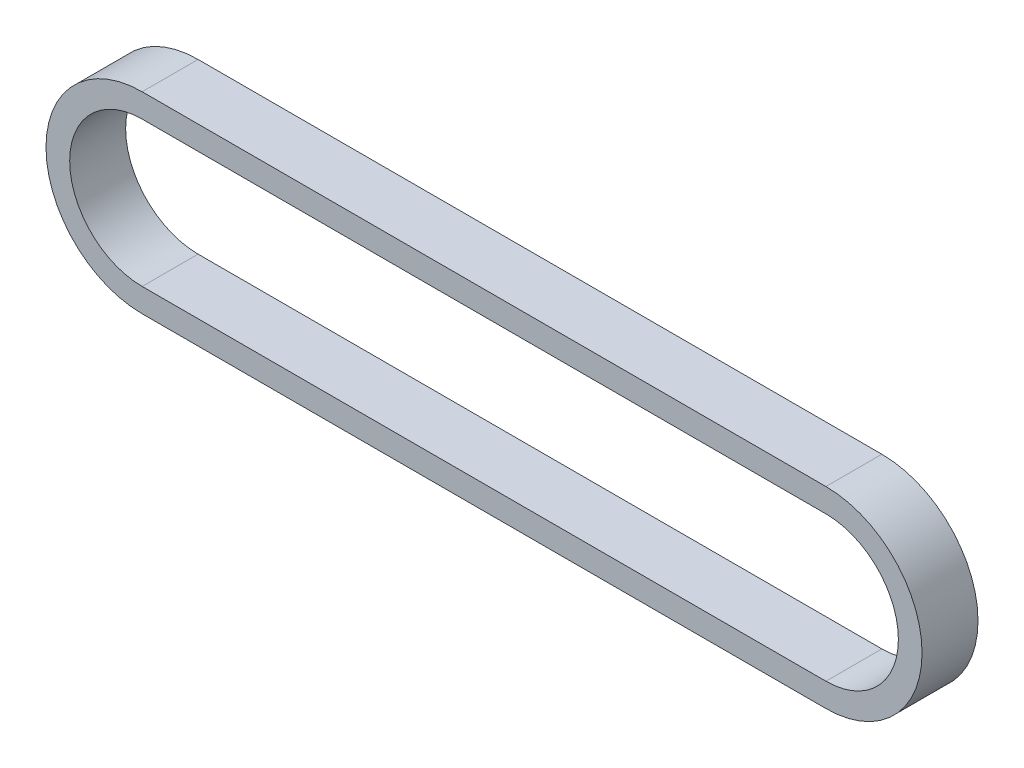
ISO-10303-21;
HEADER;
FILE_DESCRIPTION(('STEP AP214'),'2;1');
FILE_NAME('part.step','',(''),(''),'','','');
FILE_SCHEMA(('AUTOMOTIVE_DESIGN { 1 0 10303 214 1 1 1 1 }'));
ENDSEC;
DATA;
#1=APPLICATION_CONTEXT('core data for automotive mechanical design processes');
#2=APPLICATION_PROTOCOL_DEFINITION('international standard','automotive_design',2000,#1);
#3=PRODUCT_CONTEXT('',#1,'mechanical');
#4=PRODUCT('Part','Part','',(#3));
#5=PRODUCT_RELATED_PRODUCT_CATEGORY('part','',(#4));
#6=PRODUCT_DEFINITION_FORMATION('','',#4);
#7=PRODUCT_DEFINITION_CONTEXT('part definition',#1,'design');
#8=PRODUCT_DEFINITION('design','',#6,#7);
#9=PRODUCT_DEFINITION_SHAPE('','',#8);
#10=(LENGTH_UNIT() NAMED_UNIT(*) SI_UNIT(.MILLI.,.METRE.));
#11=(NAMED_UNIT(*) PLANE_ANGLE_UNIT() SI_UNIT($,.RADIAN.));
#12=(NAMED_UNIT(*) SI_UNIT($,.STERADIAN.) SOLID_ANGLE_UNIT());
#13=UNCERTAINTY_MEASURE_WITH_UNIT(LENGTH_MEASURE(1.E-05),#10,'distance_accuracy_value','');
#14=(GEOMETRIC_REPRESENTATION_CONTEXT(3) GLOBAL_UNCERTAINTY_ASSIGNED_CONTEXT((#13)) GLOBAL_UNIT_ASSIGNED_CONTEXT((#10,
#11,#12)) REPRESENTATION_CONTEXT('',''));
#15=CARTESIAN_POINT('',(0.,0.,0.));
#16=DIRECTION('',(0.,0.,1.));
#17=DIRECTION('',(1.,0.,0.));
#18=AXIS2_PLACEMENT_3D('',#15,#16,#17);
#19=CARTESIAN_POINT('',(0.,0.,4.5));
#20=DIRECTION('',(0.,0.,1.));
#21=DIRECTION('',(1.,0.,0.));
#22=AXIS2_PLACEMENT_3D('',#19,#20,#21);
#23=PLANE('',#22);
#24=CARTESIAN_POINT('',(0.,0.,4.5));
#25=DIRECTION('',(0.,0.,1.));
#26=DIRECTION('',(1.,0.,0.));
#27=AXIS2_PLACEMENT_3D('',#24,#25,#26);
#28=CIRCLE('',#27,15.4669567079091);
#29=CARTESIAN_POINT('',(0.,15.4669567079091,4.5));
#30=VERTEX_POINT('',#29);
#31=CARTESIAN_POINT('',(0.,-15.4669567079091,4.5));
#32=VERTEX_POINT('',#31);
#33=EDGE_CURVE('E158',#30,#32,#28,.T.);
#34=ORIENTED_EDGE('',*,*,#33,.T.);
#35=DIRECTION('',(1.,0.,0.));
#36=VECTOR('',#35,1.);
#37=CARTESIAN_POINT('',(0.,-15.4669567079091,4.5));
#38=LINE('',#37,#36);
#39=CARTESIAN_POINT('',(109.999999964,-15.4669567079091,4.5));
#40=VERTEX_POINT('',#39);
#41=EDGE_CURVE('E161',#32,#40,#38,.T.);
#42=ORIENTED_EDGE('',*,*,#41,.T.);
#43=CARTESIAN_POINT('',(109.999999964,0.,4.5));
#44=DIRECTION('',(0.,0.,1.));
#45=DIRECTION('',(1.,0.,0.));
#46=AXIS2_PLACEMENT_3D('',#43,#44,#45);
#47=CIRCLE('',#46,15.4669567079091);
#48=CARTESIAN_POINT('',(109.999999964,15.4669567079091,4.5));
#49=VERTEX_POINT('',#48);
#50=EDGE_CURVE('E164',#40,#49,#47,.T.);
#51=ORIENTED_EDGE('',*,*,#50,.T.);
#52=DIRECTION('',(-1.,0.,0.));
#53=VECTOR('',#52,1.);
#54=CARTESIAN_POINT('',(0.,15.4669567079091,4.5));
#55=LINE('',#54,#53);
#56=EDGE_CURVE('E166',#49,#30,#55,.T.);
#57=ORIENTED_EDGE('',*,*,#56,.T.);
#58=EDGE_LOOP('',(#34,#42,#51,#57));
#59=FACE_BOUND('',#58,.T.);
#60=DIRECTION('',(1.,0.,0.));
#61=VECTOR('',#60,1.);
#62=CARTESIAN_POINT('',(0.,-11.6569567079091,4.5));
#63=LINE('',#62,#61);
#64=CARTESIAN_POINT('',(0.,-11.6569567079091,4.5));
#65=VERTEX_POINT('',#64);
#66=CARTESIAN_POINT('',(109.999999964,-11.656956707909,4.5));
#67=VERTEX_POINT('',#66);
#68=EDGE_CURVE('E130',#65,#67,#63,.T.);
#69=ORIENTED_EDGE('',*,*,#68,.F.);
#70=CARTESIAN_POINT('',(0.,0.,4.5));
#71=DIRECTION('',(0.,0.,1.));
#72=DIRECTION('',(1.,0.,0.));
#73=AXIS2_PLACEMENT_3D('',#70,#71,#72);
#74=CIRCLE('',#73,11.6569567079091);
#75=CARTESIAN_POINT('',(0.,11.6569567079091,4.5));
#76=VERTEX_POINT('',#75);
#77=EDGE_CURVE('E122',#76,#65,#74,.T.);
#78=ORIENTED_EDGE('',*,*,#77,.F.);
#79=DIRECTION('',(-1.,0.,0.));
#80=VECTOR('',#79,1.);
#81=CARTESIAN_POINT('',(0.,11.6569567079091,4.5));
#82=LINE('',#81,#80);
#83=CARTESIAN_POINT('',(109.999999964,11.656956707909,4.5));
#84=VERTEX_POINT('',#83);
#85=EDGE_CURVE('E144',#84,#76,#82,.T.);
#86=ORIENTED_EDGE('',*,*,#85,.F.);
#87=CARTESIAN_POINT('',(109.999999964,0.,4.5));
#88=DIRECTION('',(0.,0.,1.));
#89=DIRECTION('',(1.,0.,0.));
#90=AXIS2_PLACEMENT_3D('',#87,#88,#89);
#91=CIRCLE('',#90,11.656956707909);
#92=EDGE_CURVE('E142',#67,#84,#91,.T.);
#93=ORIENTED_EDGE('',*,*,#92,.F.);
#94=EDGE_LOOP('',(#69,#78,#86,#93));
#95=FACE_BOUND('',#94,.T.);
#96=ADVANCED_FACE('F57',(#59,#95),#23,.T.);
#97=CARTESIAN_POINT('',(0.,0.,-4.5));
#98=DIRECTION('',(0.,0.,1.));
#99=DIRECTION('',(1.,0.,0.));
#100=AXIS2_PLACEMENT_3D('',#97,#98,#99);
#101=PLANE('',#100);
#102=CARTESIAN_POINT('',(0.,0.,-4.5));
#103=DIRECTION('',(0.,0.,1.));
#104=DIRECTION('',(1.,0.,0.));
#105=AXIS2_PLACEMENT_3D('',#102,#103,#104);
#106=CIRCLE('',#105,15.4669567079091);
#107=CARTESIAN_POINT('',(0.,15.4669567079091,-4.5));
#108=VERTEX_POINT('',#107);
#109=CARTESIAN_POINT('',(0.,-15.4669567079091,-4.5));
#110=VERTEX_POINT('',#109);
#111=EDGE_CURVE('E138',#108,#110,#106,.T.);
#112=ORIENTED_EDGE('',*,*,#111,.F.);
#113=DIRECTION('',(-1.,0.,0.));
#114=VECTOR('',#113,1.);
#115=CARTESIAN_POINT('',(0.,15.4669567079091,-4.5));
#116=LINE('',#115,#114);
#117=CARTESIAN_POINT('',(109.999999964,15.4669567079091,-4.5));
#118=VERTEX_POINT('',#117);
#119=EDGE_CURVE('E162',#118,#108,#116,.T.);
#120=ORIENTED_EDGE('',*,*,#119,.F.);
#121=CARTESIAN_POINT('',(109.999999964,0.,-4.5));
#122=DIRECTION('',(0.,0.,1.));
#123=DIRECTION('',(1.,0.,0.));
#124=AXIS2_PLACEMENT_3D('',#121,#122,#123);
#125=CIRCLE('',#124,15.4669567079091);
#126=CARTESIAN_POINT('',(109.999999964,-15.4669567079091,-4.5));
#127=VERTEX_POINT('',#126);
#128=EDGE_CURVE('E173',#127,#118,#125,.T.);
#129=ORIENTED_EDGE('',*,*,#128,.F.);
#130=DIRECTION('',(1.,0.,0.));
#131=VECTOR('',#130,1.);
#132=CARTESIAN_POINT('',(0.,-15.4669567079091,-4.5));
#133=LINE('',#132,#131);
#134=EDGE_CURVE('E171',#110,#127,#133,.T.);
#135=ORIENTED_EDGE('',*,*,#134,.F.);
#136=EDGE_LOOP('',(#112,#120,#129,#135));
#137=FACE_BOUND('',#136,.T.);
#138=CARTESIAN_POINT('',(0.,0.,-4.5));
#139=DIRECTION('',(0.,0.,1.));
#140=DIRECTION('',(1.,0.,0.));
#141=AXIS2_PLACEMENT_3D('',#138,#139,#140);
#142=CIRCLE('',#141,11.6569567079091);
#143=CARTESIAN_POINT('',(0.,11.6569567079091,-4.5));
#144=VERTEX_POINT('',#143);
#145=CARTESIAN_POINT('',(0.,-11.6569567079091,-4.5));
#146=VERTEX_POINT('',#145);
#147=EDGE_CURVE('E80',#144,#146,#142,.T.);
#148=ORIENTED_EDGE('',*,*,#147,.T.);
#149=DIRECTION('',(1.,0.,0.));
#150=VECTOR('',#149,1.);
#151=CARTESIAN_POINT('',(0.,-11.6569567079091,-4.5));
#152=LINE('',#151,#150);
#153=CARTESIAN_POINT('',(109.999999964,-11.656956707909,-4.5));
#154=VERTEX_POINT('',#153);
#155=EDGE_CURVE('E137',#146,#154,#152,.T.);
#156=ORIENTED_EDGE('',*,*,#155,.T.);
#157=CARTESIAN_POINT('',(109.999999964,0.,-4.5));
#158=DIRECTION('',(0.,0.,1.));
#159=DIRECTION('',(1.,0.,0.));
#160=AXIS2_PLACEMENT_3D('',#157,#158,#159);
#161=CIRCLE('',#160,11.656956707909);
#162=CARTESIAN_POINT('',(109.999999964,11.656956707909,-4.5));
#163=VERTEX_POINT('',#162);
#164=EDGE_CURVE('E150',#154,#163,#161,.T.);
#165=ORIENTED_EDGE('',*,*,#164,.T.);
#166=DIRECTION('',(-1.,0.,0.));
#167=VECTOR('',#166,1.);
#168=CARTESIAN_POINT('',(0.,11.6569567079091,-4.5));
#169=LINE('',#168,#167);
#170=EDGE_CURVE('E131',#163,#144,#169,.T.);
#171=ORIENTED_EDGE('',*,*,#170,.T.);
#172=EDGE_LOOP('',(#148,#156,#165,#171));
#173=FACE_BOUND('',#172,.T.);
#174=ADVANCED_FACE('F191',(#137,#173),#101,.F.);
#175=CARTESIAN_POINT('',(0.,0.,4.5));
#176=DIRECTION('',(0.,0.,-1.));
#177=DIRECTION('',(-1.,0.,0.));
#178=AXIS2_PLACEMENT_3D('',#175,#176,#177);
#179=CYLINDRICAL_SURFACE('',#178,15.4669567079091);
#180=ORIENTED_EDGE('',*,*,#111,.T.);
#181=DIRECTION('',(0.,0.,-1.));
#182=VECTOR('',#181,1.);
#183=CARTESIAN_POINT('',(0.,-15.4669567079091,4.5));
#184=LINE('',#183,#182);
#185=EDGE_CURVE('E12',#32,#110,#184,.T.);
#186=ORIENTED_EDGE('',*,*,#185,.F.);
#187=ORIENTED_EDGE('',*,*,#33,.F.);
#188=DIRECTION('',(0.,0.,-1.));
#189=VECTOR('',#188,1.);
#190=CARTESIAN_POINT('',(0.,15.4669567079091,4.5));
#191=LINE('',#190,#189);
#192=EDGE_CURVE('E168',#30,#108,#191,.T.);
#193=ORIENTED_EDGE('',*,*,#192,.T.);
#194=EDGE_LOOP('',(#180,#186,#187,#193));
#195=FACE_BOUND('',#194,.T.);
#196=ADVANCED_FACE('F59',(#195),#179,.T.);
#197=CARTESIAN_POINT('',(0.,-15.4669567079091,4.5));
#198=DIRECTION('',(0.,1.,0.));
#199=DIRECTION('',(-1.,0.,0.));
#200=AXIS2_PLACEMENT_3D('',#197,#198,#199);
#201=PLANE('',#200);
#202=ORIENTED_EDGE('',*,*,#134,.T.);
#203=DIRECTION('',(0.,0.,-1.));
#204=VECTOR('',#203,1.);
#205=CARTESIAN_POINT('',(109.999999964,-15.4669567079091,4.5));
#206=LINE('',#205,#204);
#207=EDGE_CURVE('E65',#40,#127,#206,.T.);
#208=ORIENTED_EDGE('',*,*,#207,.F.);
#209=ORIENTED_EDGE('',*,*,#41,.F.);
#210=ORIENTED_EDGE('',*,*,#185,.T.);
#211=EDGE_LOOP('',(#202,#208,#209,#210));
#212=FACE_BOUND('',#211,.T.);
#213=ADVANCED_FACE('F201',(#212),#201,.F.);
#214=CARTESIAN_POINT('',(109.999999964,0.,4.5));
#215=DIRECTION('',(0.,0.,-1.));
#216=DIRECTION('',(-1.,0.,0.));
#217=AXIS2_PLACEMENT_3D('',#214,#215,#216);
#218=CYLINDRICAL_SURFACE('',#217,15.4669567079091);
#219=ORIENTED_EDGE('',*,*,#128,.T.);
#220=DIRECTION('',(0.,0.,-1.));
#221=VECTOR('',#220,1.);
#222=CARTESIAN_POINT('',(109.999999964,15.4669567079091,4.5));
#223=LINE('',#222,#221);
#224=EDGE_CURVE('E178',#49,#118,#223,.T.);
#225=ORIENTED_EDGE('',*,*,#224,.F.);
#226=ORIENTED_EDGE('',*,*,#50,.F.);
#227=ORIENTED_EDGE('',*,*,#207,.T.);
#228=EDGE_LOOP('',(#219,#225,#226,#227));
#229=FACE_BOUND('',#228,.T.);
#230=ADVANCED_FACE('F185',(#229),#218,.T.);
#231=CARTESIAN_POINT('',(0.,15.4669567079091,4.5));
#232=DIRECTION('',(0.,-1.,0.));
#233=DIRECTION('',(1.,0.,0.));
#234=AXIS2_PLACEMENT_3D('',#231,#232,#233);
#235=PLANE('',#234);
#236=ORIENTED_EDGE('',*,*,#119,.T.);
#237=ORIENTED_EDGE('',*,*,#192,.F.);
#238=ORIENTED_EDGE('',*,*,#56,.F.);
#239=ORIENTED_EDGE('',*,*,#224,.T.);
#240=EDGE_LOOP('',(#236,#237,#238,#239));
#241=FACE_BOUND('',#240,.T.);
#242=ADVANCED_FACE('F195',(#241),#235,.F.);
#243=CARTESIAN_POINT('',(0.,0.,4.5));
#244=DIRECTION('',(0.,0.,-1.));
#245=DIRECTION('',(-1.,0.,0.));
#246=AXIS2_PLACEMENT_3D('',#243,#244,#245);
#247=CYLINDRICAL_SURFACE('',#246,11.6569567079091);
#248=ORIENTED_EDGE('',*,*,#147,.F.);
#249=DIRECTION('',(0.,0.,-1.));
#250=VECTOR('',#249,1.);
#251=CARTESIAN_POINT('',(0.,11.6569567079091,4.5));
#252=LINE('',#251,#250);
#253=EDGE_CURVE('E126',#76,#144,#252,.T.);
#254=ORIENTED_EDGE('',*,*,#253,.F.);
#255=ORIENTED_EDGE('',*,*,#77,.T.);
#256=DIRECTION('',(0.,0.,-1.));
#257=VECTOR('',#256,1.);
#258=CARTESIAN_POINT('',(0.,-11.6569567079091,4.5));
#259=LINE('',#258,#257);
#260=EDGE_CURVE('E125',#65,#146,#259,.T.);
#261=ORIENTED_EDGE('',*,*,#260,.T.);
#262=EDGE_LOOP('',(#248,#254,#255,#261));
#263=FACE_BOUND('',#262,.T.);
#264=ADVANCED_FACE('F124',(#263),#247,.F.);
#265=CARTESIAN_POINT('',(0.,-11.6569567079091,4.5));
#266=DIRECTION('',(0.,1.,0.));
#267=DIRECTION('',(-1.,0.,0.));
#268=AXIS2_PLACEMENT_3D('',#265,#266,#267);
#269=PLANE('',#268);
#270=ORIENTED_EDGE('',*,*,#155,.F.);
#271=ORIENTED_EDGE('',*,*,#260,.F.);
#272=ORIENTED_EDGE('',*,*,#68,.T.);
#273=DIRECTION('',(0.,0.,-1.));
#274=VECTOR('',#273,1.);
#275=CARTESIAN_POINT('',(109.999999964,-11.656956707909,4.5));
#276=LINE('',#275,#274);
#277=EDGE_CURVE('E139',#67,#154,#276,.T.);
#278=ORIENTED_EDGE('',*,*,#277,.T.);
#279=EDGE_LOOP('',(#270,#271,#272,#278));
#280=FACE_BOUND('',#279,.T.);
#281=ADVANCED_FACE('F134',(#280),#269,.T.);
#282=CARTESIAN_POINT('',(109.999999964,0.,4.5));
#283=DIRECTION('',(0.,0.,-1.));
#284=DIRECTION('',(-1.,0.,0.));
#285=AXIS2_PLACEMENT_3D('',#282,#283,#284);
#286=CYLINDRICAL_SURFACE('',#285,11.656956707909);
#287=ORIENTED_EDGE('',*,*,#164,.F.);
#288=ORIENTED_EDGE('',*,*,#277,.F.);
#289=ORIENTED_EDGE('',*,*,#92,.T.);
#290=DIRECTION('',(0.,0.,-1.));
#291=VECTOR('',#290,1.);
#292=CARTESIAN_POINT('',(109.999999964,11.656956707909,4.5));
#293=LINE('',#292,#291);
#294=EDGE_CURVE('E72',#84,#163,#293,.T.);
#295=ORIENTED_EDGE('',*,*,#294,.T.);
#296=EDGE_LOOP('',(#287,#288,#289,#295));
#297=FACE_BOUND('',#296,.T.);
#298=ADVANCED_FACE('F224',(#297),#286,.F.);
#299=CARTESIAN_POINT('',(0.,11.6569567079091,4.5));
#300=DIRECTION('',(0.,-1.,0.));
#301=DIRECTION('',(1.,0.,0.));
#302=AXIS2_PLACEMENT_3D('',#299,#300,#301);
#303=PLANE('',#302);
#304=ORIENTED_EDGE('',*,*,#170,.F.);
#305=ORIENTED_EDGE('',*,*,#294,.F.);
#306=ORIENTED_EDGE('',*,*,#85,.T.);
#307=ORIENTED_EDGE('',*,*,#253,.T.);
#308=EDGE_LOOP('',(#304,#305,#306,#307));
#309=FACE_BOUND('',#308,.T.);
#310=ADVANCED_FACE('F228',(#309),#303,.T.);
#311=CLOSED_SHELL('',(#96,#174,#196,#213,#230,#242,#264,#281,#298,#310));
#312=MANIFOLD_SOLID_BREP('B2',#311);
#313=ADVANCED_BREP_SHAPE_REPRESENTATION('',(#18,#312),#14);
#314=SHAPE_DEFINITION_REPRESENTATION(#9,#313);
ENDSEC;
END-ISO-10303-21;
